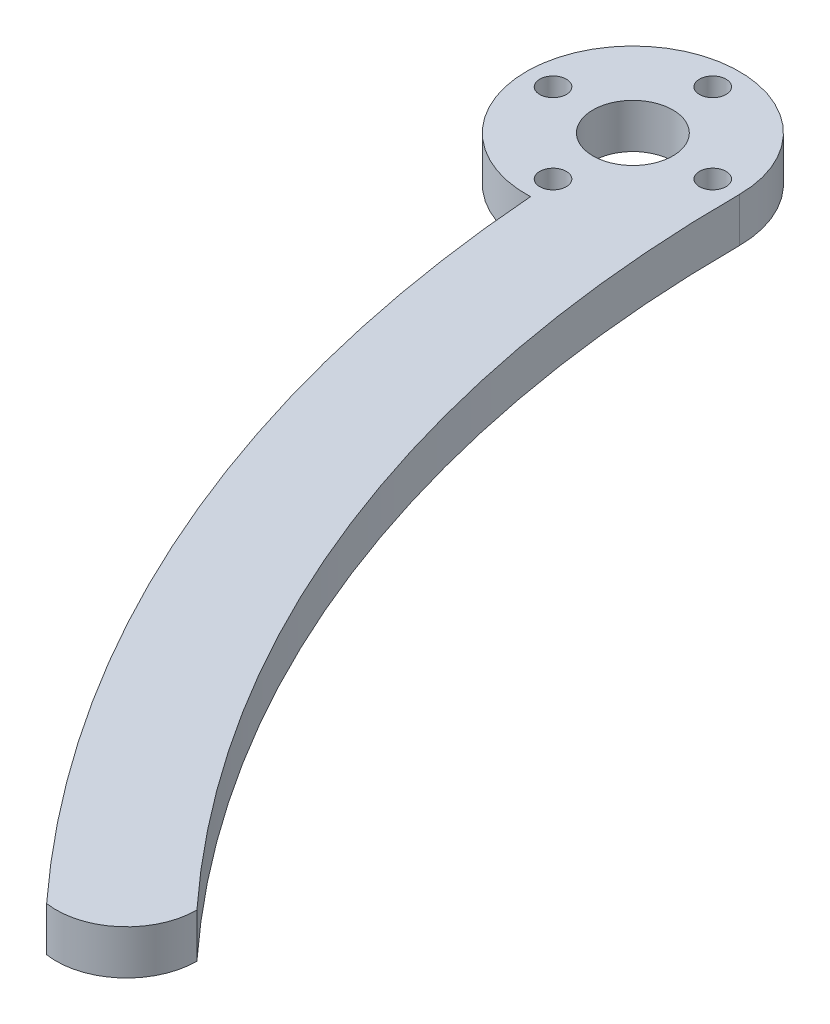
ISO-10303-21;
HEADER;
FILE_DESCRIPTION(('STEP AP214'),'2;1');
FILE_NAME('part.step','',(''),(''),'','','');
FILE_SCHEMA(('AUTOMOTIVE_DESIGN { 1 0 10303 214 1 1 1 1 }'));
ENDSEC;
DATA;
#1=APPLICATION_CONTEXT('core data for automotive mechanical design processes');
#2=APPLICATION_PROTOCOL_DEFINITION('international standard','automotive_design',2000,#1);
#3=PRODUCT_CONTEXT('',#1,'mechanical');
#4=PRODUCT('Part','Part','',(#3));
#5=PRODUCT_RELATED_PRODUCT_CATEGORY('part','',(#4));
#6=PRODUCT_DEFINITION_FORMATION('','',#4);
#7=PRODUCT_DEFINITION_CONTEXT('part definition',#1,'design');
#8=PRODUCT_DEFINITION('design','',#6,#7);
#9=PRODUCT_DEFINITION_SHAPE('','',#8);
#10=(LENGTH_UNIT() NAMED_UNIT(*) SI_UNIT(.MILLI.,.METRE.));
#11=(NAMED_UNIT(*) PLANE_ANGLE_UNIT() SI_UNIT($,.RADIAN.));
#12=(NAMED_UNIT(*) SI_UNIT($,.STERADIAN.) SOLID_ANGLE_UNIT());
#13=UNCERTAINTY_MEASURE_WITH_UNIT(LENGTH_MEASURE(1.E-05),#10,'distance_accuracy_value','');
#14=(GEOMETRIC_REPRESENTATION_CONTEXT(3) GLOBAL_UNCERTAINTY_ASSIGNED_CONTEXT((#13)) GLOBAL_UNIT_ASSIGNED_CONTEXT((#10,
#11,#12)) REPRESENTATION_CONTEXT('',''));
#15=CARTESIAN_POINT('',(0.,0.,0.));
#16=DIRECTION('',(0.,0.,1.));
#17=DIRECTION('',(1.,0.,0.));
#18=AXIS2_PLACEMENT_3D('',#15,#16,#17);
#19=CARTESIAN_POINT('',(-116.644673393361,5.,100.415487414475));
#20=DIRECTION('',(0.,-1.,0.));
#21=DIRECTION('',(0.,0.,-1.));
#22=AXIS2_PLACEMENT_3D('',#19,#20,#21);
#23=CYLINDRICAL_SURFACE('',#22,7.92149331057751);
#24=CARTESIAN_POINT('',(-116.644673393361,0.,100.415487414475));
#25=DIRECTION('',(0.,1.,0.));
#26=DIRECTION('',(0.,0.,1.));
#27=AXIS2_PLACEMENT_3D('',#24,#25,#26);
#28=CIRCLE('',#27,7.92149331057751);
#29=CARTESIAN_POINT('',(-108.723180082783,0.,100.415487414475));
#30=VERTEX_POINT('',#29);
#31=CARTESIAN_POINT('',(-117.822638991063,0.,108.248906420258));
#32=VERTEX_POINT('',#31);
#33=EDGE_CURVE('E101',#30,#32,#28,.F.);
#34=ORIENTED_EDGE('',*,*,#33,.F.);
#35=DIRECTION('',(0.,-1.,0.));
#36=VECTOR('',#35,1.);
#37=CARTESIAN_POINT('',(-108.723180082783,5.,100.415487414475));
#38=LINE('',#37,#36);
#39=CARTESIAN_POINT('',(-108.723180082783,5.,100.415487414475));
#40=VERTEX_POINT('',#39);
#41=EDGE_CURVE('E11',#40,#30,#38,.T.);
#42=ORIENTED_EDGE('',*,*,#41,.F.);
#43=CARTESIAN_POINT('',(-116.644673393361,5.,100.415487414475));
#44=DIRECTION('',(0.,1.,0.));
#45=DIRECTION('',(0.,0.,1.));
#46=AXIS2_PLACEMENT_3D('',#43,#44,#45);
#47=CIRCLE('',#46,7.92149331057751);
#48=CARTESIAN_POINT('',(-117.822638991063,5.,108.248906420258));
#49=VERTEX_POINT('',#48);
#50=EDGE_CURVE('E86',#40,#49,#47,.F.);
#51=ORIENTED_EDGE('',*,*,#50,.T.);
#52=DIRECTION('',(0.,-1.,0.));
#53=VECTOR('',#52,1.);
#54=CARTESIAN_POINT('',(-117.822638991063,5.,108.248906420258));
#55=LINE('',#54,#53);
#56=EDGE_CURVE('E74',#49,#32,#55,.T.);
#57=ORIENTED_EDGE('',*,*,#56,.T.);
#58=EDGE_LOOP('',(#34,#42,#51,#57));
#59=FACE_BOUND('',#58,.T.);
#60=ADVANCED_FACE('F35',(#59),#23,.T.);
#61=CARTESIAN_POINT('',(0.,5.,0.));
#62=DIRECTION('',(0.,-1.,0.));
#63=DIRECTION('',(0.,0.,-1.));
#64=AXIS2_PLACEMENT_3D('',#61,#62,#63);
#65=CYLINDRICAL_SURFACE('',#64,148.);
#66=CARTESIAN_POINT('',(0.,0.,0.));
#67=DIRECTION('',(0.,1.,0.));
#68=DIRECTION('',(0.,0.,1.));
#69=AXIS2_PLACEMENT_3D('',#66,#67,#68);
#70=CIRCLE('',#69,148.);
#71=CARTESIAN_POINT('',(-148.,0.,0.));
#72=VERTEX_POINT('',#71);
#73=EDGE_CURVE('E91',#30,#72,#70,.F.);
#74=ORIENTED_EDGE('',*,*,#73,.T.);
#75=DIRECTION('',(0.,-1.,0.));
#76=VECTOR('',#75,1.);
#77=CARTESIAN_POINT('',(-148.,5.,0.));
#78=LINE('',#77,#76);
#79=CARTESIAN_POINT('',(-148.,5.,0.));
#80=VERTEX_POINT('',#79);
#81=EDGE_CURVE('E43',#80,#72,#78,.T.);
#82=ORIENTED_EDGE('',*,*,#81,.F.);
#83=CARTESIAN_POINT('',(0.,5.,0.));
#84=DIRECTION('',(0.,1.,0.));
#85=DIRECTION('',(0.,0.,1.));
#86=AXIS2_PLACEMENT_3D('',#83,#84,#85);
#87=CIRCLE('',#86,148.);
#88=EDGE_CURVE('E80',#40,#80,#87,.F.);
#89=ORIENTED_EDGE('',*,*,#88,.F.);
#90=ORIENTED_EDGE('',*,*,#41,.T.);
#91=EDGE_LOOP('',(#74,#82,#89,#90));
#92=FACE_BOUND('',#91,.T.);
#93=ADVANCED_FACE('F89',(#92),#65,.F.);
#94=CARTESIAN_POINT('',(-160.,5.,0.));
#95=DIRECTION('',(0.,-1.,0.));
#96=DIRECTION('',(0.,0.,-1.));
#97=AXIS2_PLACEMENT_3D('',#94,#95,#96);
#98=CYLINDRICAL_SURFACE('',#97,12.);
#99=CARTESIAN_POINT('',(-160.,0.,0.));
#100=DIRECTION('',(0.,1.,0.));
#101=DIRECTION('',(0.,0.,1.));
#102=AXIS2_PLACEMENT_3D('',#99,#100,#101);
#103=CIRCLE('',#102,12.);
#104=CARTESIAN_POINT('',(-159.55,0.,11.9915595316039));
#105=VERTEX_POINT('',#104);
#106=EDGE_CURVE('E67',#72,#105,#103,.T.);
#107=ORIENTED_EDGE('',*,*,#106,.T.);
#108=DIRECTION('',(0.,-1.,0.));
#109=VECTOR('',#108,1.);
#110=CARTESIAN_POINT('',(-159.55,5.,11.9915595316039));
#111=LINE('',#110,#109);
#112=CARTESIAN_POINT('',(-159.55,5.,11.9915595316039));
#113=VERTEX_POINT('',#112);
#114=EDGE_CURVE('E92',#113,#105,#111,.T.);
#115=ORIENTED_EDGE('',*,*,#114,.F.);
#116=CARTESIAN_POINT('',(-160.,5.,0.));
#117=DIRECTION('',(0.,1.,0.));
#118=DIRECTION('',(0.,0.,1.));
#119=AXIS2_PLACEMENT_3D('',#116,#117,#118);
#120=CIRCLE('',#119,12.);
#121=EDGE_CURVE('E85',#80,#113,#120,.T.);
#122=ORIENTED_EDGE('',*,*,#121,.F.);
#123=ORIENTED_EDGE('',*,*,#81,.T.);
#124=EDGE_LOOP('',(#107,#115,#122,#123));
#125=FACE_BOUND('',#124,.T.);
#126=ADVANCED_FACE('F93',(#125),#98,.T.);
#127=CARTESIAN_POINT('',(0.,5.,0.));
#128=DIRECTION('',(0.,-1.,0.));
#129=DIRECTION('',(0.,0.,-1.));
#130=AXIS2_PLACEMENT_3D('',#127,#128,#129);
#131=CYLINDRICAL_SURFACE('',#130,160.);
#132=CARTESIAN_POINT('',(0.,0.,0.));
#133=DIRECTION('',(0.,1.,0.));
#134=DIRECTION('',(0.,0.,1.));
#135=AXIS2_PLACEMENT_3D('',#132,#133,#134);
#136=CIRCLE('',#135,160.);
#137=EDGE_CURVE('E107',#105,#32,#136,.T.);
#138=ORIENTED_EDGE('',*,*,#137,.T.);
#139=ORIENTED_EDGE('',*,*,#56,.F.);
#140=CARTESIAN_POINT('',(0.,5.,0.));
#141=DIRECTION('',(0.,1.,0.));
#142=DIRECTION('',(0.,0.,1.));
#143=AXIS2_PLACEMENT_3D('',#140,#141,#142);
#144=CIRCLE('',#143,160.);
#145=EDGE_CURVE('E51',#113,#49,#144,.T.);
#146=ORIENTED_EDGE('',*,*,#145,.F.);
#147=ORIENTED_EDGE('',*,*,#114,.T.);
#148=EDGE_LOOP('',(#138,#139,#146,#147));
#149=FACE_BOUND('',#148,.T.);
#150=ADVANCED_FACE('F115',(#149),#131,.T.);
#151=CARTESIAN_POINT('',(-160.,5.,0.));
#152=DIRECTION('',(0.,-1.,0.));
#153=DIRECTION('',(0.,0.,-1.));
#154=AXIS2_PLACEMENT_3D('',#151,#152,#153);
#155=CYLINDRICAL_SURFACE('',#154,4.49999999999999);
#156=CARTESIAN_POINT('',(-160.,5.,0.));
#157=DIRECTION('',(0.,1.,0.));
#158=DIRECTION('',(0.,0.,1.));
#159=AXIS2_PLACEMENT_3D('',#156,#157,#158);
#160=CIRCLE('',#159,4.49999999999999);
#161=CARTESIAN_POINT('',(-160.,5.,4.49999999999999));
#162=VERTEX_POINT('',#161);
#163=EDGE_CURVE('E95',#162,#162,#160,.T.);
#164=ORIENTED_EDGE('',*,*,#163,.T.);
#165=EDGE_LOOP('',(#164));
#166=FACE_BOUND('',#165,.T.);
#167=CARTESIAN_POINT('',(-160.,0.,0.));
#168=DIRECTION('',(0.,1.,0.));
#169=DIRECTION('',(0.,0.,1.));
#170=AXIS2_PLACEMENT_3D('',#167,#168,#169);
#171=CIRCLE('',#170,4.49999999999999);
#172=CARTESIAN_POINT('',(-160.,0.,4.49999999999999));
#173=VERTEX_POINT('',#172);
#174=EDGE_CURVE('E109',#173,#173,#171,.T.);
#175=ORIENTED_EDGE('',*,*,#174,.F.);
#176=EDGE_LOOP('',(#175));
#177=FACE_BOUND('',#176,.T.);
#178=ADVANCED_FACE('F130',(#166,#177),#155,.F.);
#179=CARTESIAN_POINT('',(0.,5.,0.));
#180=DIRECTION('',(0.,1.,0.));
#181=DIRECTION('',(0.,0.,1.));
#182=AXIS2_PLACEMENT_3D('',#179,#180,#181);
#183=PLANE('',#182);
#184=CARTESIAN_POINT('',(-160.,5.,-8.99999999999999));
#185=DIRECTION('',(0.,1.,0.));
#186=DIRECTION('',(0.,0.,1.));
#187=AXIS2_PLACEMENT_3D('',#184,#185,#186);
#188=CIRCLE('',#187,1.5);
#189=CARTESIAN_POINT('',(-160.,5.,-7.5));
#190=VERTEX_POINT('',#189);
#191=EDGE_CURVE('E163',#190,#190,#188,.T.);
#192=ORIENTED_EDGE('',*,*,#191,.F.);
#193=EDGE_LOOP('',(#192));
#194=FACE_BOUND('',#193,.T.);
#195=CARTESIAN_POINT('',(-169.,5.,0.));
#196=DIRECTION('',(0.,1.,0.));
#197=DIRECTION('',(0.,0.,1.));
#198=AXIS2_PLACEMENT_3D('',#195,#196,#197);
#199=CIRCLE('',#198,1.5);
#200=CARTESIAN_POINT('',(-169.,5.,1.5));
#201=VERTEX_POINT('',#200);
#202=EDGE_CURVE('E165',#201,#201,#199,.T.);
#203=ORIENTED_EDGE('',*,*,#202,.F.);
#204=EDGE_LOOP('',(#203));
#205=FACE_BOUND('',#204,.T.);
#206=CARTESIAN_POINT('',(-160.,5.,8.99999999999999));
#207=DIRECTION('',(0.,1.,0.));
#208=DIRECTION('',(0.,0.,1.));
#209=AXIS2_PLACEMENT_3D('',#206,#207,#208);
#210=CIRCLE('',#209,1.5);
#211=CARTESIAN_POINT('',(-160.,5.,10.5));
#212=VERTEX_POINT('',#211);
#213=EDGE_CURVE('E171',#212,#212,#210,.T.);
#214=ORIENTED_EDGE('',*,*,#213,.F.);
#215=EDGE_LOOP('',(#214));
#216=FACE_BOUND('',#215,.T.);
#217=CARTESIAN_POINT('',(-151.,5.,0.));
#218=DIRECTION('',(0.,1.,0.));
#219=DIRECTION('',(0.,0.,1.));
#220=AXIS2_PLACEMENT_3D('',#217,#218,#219);
#221=CIRCLE('',#220,1.5);
#222=CARTESIAN_POINT('',(-151.,5.,1.5));
#223=VERTEX_POINT('',#222);
#224=EDGE_CURVE('E177',#223,#223,#221,.T.);
#225=ORIENTED_EDGE('',*,*,#224,.F.);
#226=EDGE_LOOP('',(#225));
#227=FACE_BOUND('',#226,.T.);
#228=ORIENTED_EDGE('',*,*,#50,.F.);
#229=ORIENTED_EDGE('',*,*,#88,.T.);
#230=ORIENTED_EDGE('',*,*,#121,.T.);
#231=ORIENTED_EDGE('',*,*,#145,.T.);
#232=EDGE_LOOP('',(#228,#229,#230,#231));
#233=FACE_BOUND('',#232,.T.);
#234=ORIENTED_EDGE('',*,*,#163,.F.);
#235=EDGE_LOOP('',(#234));
#236=FACE_BOUND('',#235,.T.);
#237=ADVANCED_FACE('F82',(#194,#205,#216,#227,#233,#236),#183,.T.);
#238=CARTESIAN_POINT('',(0.,0.,0.));
#239=DIRECTION('',(0.,1.,0.));
#240=DIRECTION('',(0.,0.,1.));
#241=AXIS2_PLACEMENT_3D('',#238,#239,#240);
#242=PLANE('',#241);
#243=CARTESIAN_POINT('',(-160.,0.,-8.99999999999999));
#244=DIRECTION('',(0.,1.,0.));
#245=DIRECTION('',(0.,0.,1.));
#246=AXIS2_PLACEMENT_3D('',#243,#244,#245);
#247=CIRCLE('',#246,1.5);
#248=CARTESIAN_POINT('',(-160.,0.,-7.5));
#249=VERTEX_POINT('',#248);
#250=EDGE_CURVE('E160',#249,#249,#247,.T.);
#251=ORIENTED_EDGE('',*,*,#250,.T.);
#252=EDGE_LOOP('',(#251));
#253=FACE_BOUND('',#252,.T.);
#254=CARTESIAN_POINT('',(-169.,0.,0.));
#255=DIRECTION('',(0.,1.,0.));
#256=DIRECTION('',(0.,0.,1.));
#257=AXIS2_PLACEMENT_3D('',#254,#255,#256);
#258=CIRCLE('',#257,1.5);
#259=CARTESIAN_POINT('',(-169.,0.,1.5));
#260=VERTEX_POINT('',#259);
#261=EDGE_CURVE('E168',#260,#260,#258,.T.);
#262=ORIENTED_EDGE('',*,*,#261,.T.);
#263=EDGE_LOOP('',(#262));
#264=FACE_BOUND('',#263,.T.);
#265=CARTESIAN_POINT('',(-160.,0.,8.99999999999999));
#266=DIRECTION('',(0.,1.,0.));
#267=DIRECTION('',(0.,0.,1.));
#268=AXIS2_PLACEMENT_3D('',#265,#266,#267);
#269=CIRCLE('',#268,1.5);
#270=CARTESIAN_POINT('',(-160.,0.,10.5));
#271=VERTEX_POINT('',#270);
#272=EDGE_CURVE('E174',#271,#271,#269,.T.);
#273=ORIENTED_EDGE('',*,*,#272,.T.);
#274=EDGE_LOOP('',(#273));
#275=FACE_BOUND('',#274,.T.);
#276=CARTESIAN_POINT('',(-151.,0.,0.));
#277=DIRECTION('',(0.,1.,0.));
#278=DIRECTION('',(0.,0.,1.));
#279=AXIS2_PLACEMENT_3D('',#276,#277,#278);
#280=CIRCLE('',#279,1.5);
#281=CARTESIAN_POINT('',(-151.,0.,1.5));
#282=VERTEX_POINT('',#281);
#283=EDGE_CURVE('E104',#282,#282,#280,.T.);
#284=ORIENTED_EDGE('',*,*,#283,.T.);
#285=EDGE_LOOP('',(#284));
#286=FACE_BOUND('',#285,.T.);
#287=ORIENTED_EDGE('',*,*,#33,.T.);
#288=ORIENTED_EDGE('',*,*,#137,.F.);
#289=ORIENTED_EDGE('',*,*,#106,.F.);
#290=ORIENTED_EDGE('',*,*,#73,.F.);
#291=EDGE_LOOP('',(#287,#288,#289,#290));
#292=FACE_BOUND('',#291,.T.);
#293=ORIENTED_EDGE('',*,*,#174,.T.);
#294=EDGE_LOOP('',(#293));
#295=FACE_BOUND('',#294,.T.);
#296=ADVANCED_FACE('F117',(#253,#264,#275,#286,#292,#295),#242,.F.);
#297=CARTESIAN_POINT('',(-151.,0.,0.));
#298=DIRECTION('',(0.,1.,0.));
#299=DIRECTION('',(0.,0.,1.));
#300=AXIS2_PLACEMENT_3D('',#297,#298,#299);
#301=CYLINDRICAL_SURFACE('',#300,1.5);
#302=ORIENTED_EDGE('',*,*,#283,.F.);
#303=EDGE_LOOP('',(#302));
#304=FACE_BOUND('',#303,.T.);
#305=ORIENTED_EDGE('',*,*,#224,.T.);
#306=EDGE_LOOP('',(#305));
#307=FACE_BOUND('',#306,.T.);
#308=ADVANCED_FACE('F136',(#304,#307),#301,.F.);
#309=CARTESIAN_POINT('',(-160.,0.,8.99999999999999));
#310=DIRECTION('',(0.,1.,0.));
#311=DIRECTION('',(0.,0.,1.));
#312=AXIS2_PLACEMENT_3D('',#309,#310,#311);
#313=CYLINDRICAL_SURFACE('',#312,1.5);
#314=ORIENTED_EDGE('',*,*,#272,.F.);
#315=EDGE_LOOP('',(#314));
#316=FACE_BOUND('',#315,.T.);
#317=ORIENTED_EDGE('',*,*,#213,.T.);
#318=EDGE_LOOP('',(#317));
#319=FACE_BOUND('',#318,.T.);
#320=ADVANCED_FACE('F143',(#316,#319),#313,.F.);
#321=CARTESIAN_POINT('',(-169.,0.,0.));
#322=DIRECTION('',(0.,1.,0.));
#323=DIRECTION('',(0.,0.,1.));
#324=AXIS2_PLACEMENT_3D('',#321,#322,#323);
#325=CYLINDRICAL_SURFACE('',#324,1.5);
#326=ORIENTED_EDGE('',*,*,#261,.F.);
#327=EDGE_LOOP('',(#326));
#328=FACE_BOUND('',#327,.T.);
#329=ORIENTED_EDGE('',*,*,#202,.T.);
#330=EDGE_LOOP('',(#329));
#331=FACE_BOUND('',#330,.T.);
#332=ADVANCED_FACE('F147',(#328,#331),#325,.F.);
#333=CARTESIAN_POINT('',(-160.,0.,-8.99999999999999));
#334=DIRECTION('',(0.,1.,0.));
#335=DIRECTION('',(0.,0.,1.));
#336=AXIS2_PLACEMENT_3D('',#333,#334,#335);
#337=CYLINDRICAL_SURFACE('',#336,1.5);
#338=ORIENTED_EDGE('',*,*,#250,.F.);
#339=EDGE_LOOP('',(#338));
#340=FACE_BOUND('',#339,.T.);
#341=ORIENTED_EDGE('',*,*,#191,.T.);
#342=EDGE_LOOP('',(#341));
#343=FACE_BOUND('',#342,.T.);
#344=ADVANCED_FACE('F151',(#340,#343),#337,.F.);
#345=CLOSED_SHELL('',(#60,#93,#126,#150,#178,#237,#296,#308,#320,#332,#344));
#346=MANIFOLD_SOLID_BREP('B2',#345);
#347=ADVANCED_BREP_SHAPE_REPRESENTATION('',(#18,#346),#14);
#348=SHAPE_DEFINITION_REPRESENTATION(#9,#347);
ENDSEC;
END-ISO-10303-21;
